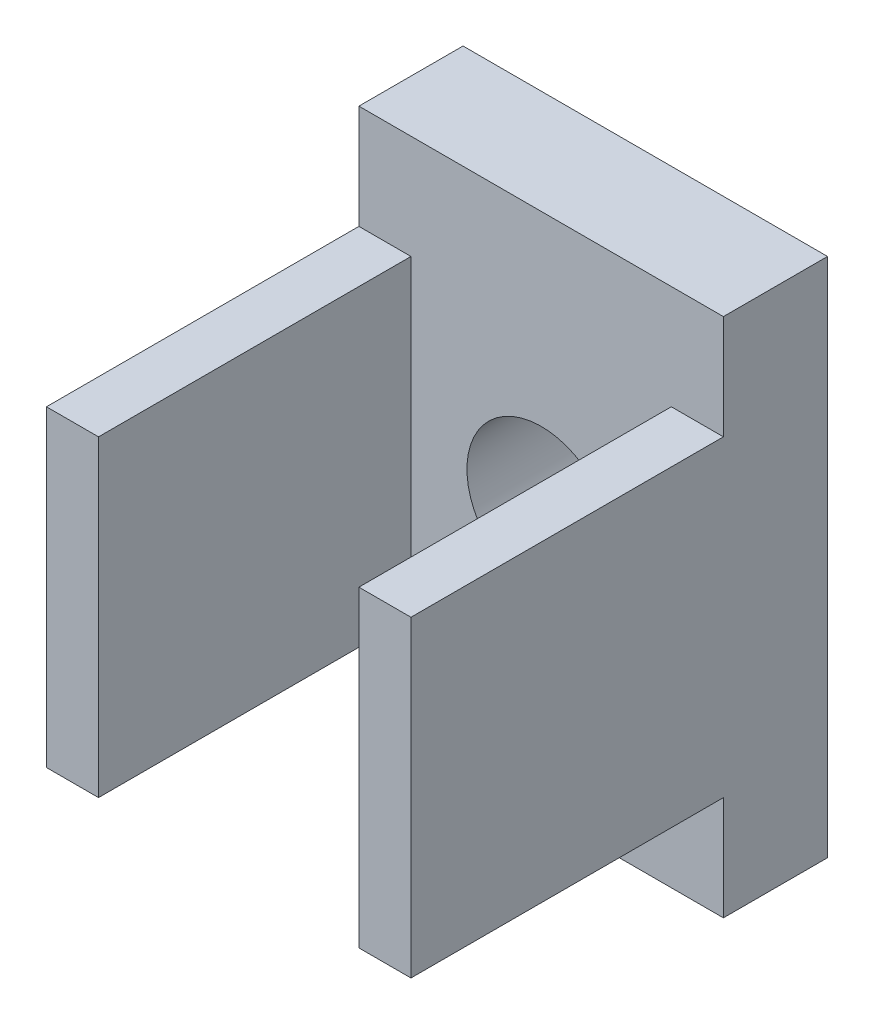
ISO-10303-21;
HEADER;
FILE_DESCRIPTION(('STEP AP214'),'2;1');
FILE_NAME('part.step','',(''),(''),'','','');
FILE_SCHEMA(('AUTOMOTIVE_DESIGN { 1 0 10303 214 1 1 1 1 }'));
ENDSEC;
DATA;
#1=APPLICATION_CONTEXT('core data for automotive mechanical design processes');
#2=APPLICATION_PROTOCOL_DEFINITION('international standard','automotive_design',2000,#1);
#3=PRODUCT_CONTEXT('',#1,'mechanical');
#4=PRODUCT('Part','Part','',(#3));
#5=PRODUCT_RELATED_PRODUCT_CATEGORY('part','',(#4));
#6=PRODUCT_DEFINITION_FORMATION('','',#4);
#7=PRODUCT_DEFINITION_CONTEXT('part definition',#1,'design');
#8=PRODUCT_DEFINITION('design','',#6,#7);
#9=PRODUCT_DEFINITION_SHAPE('','',#8);
#10=(LENGTH_UNIT() NAMED_UNIT(*) SI_UNIT(.MILLI.,.METRE.));
#11=(NAMED_UNIT(*) PLANE_ANGLE_UNIT() SI_UNIT($,.RADIAN.));
#12=(NAMED_UNIT(*) SI_UNIT($,.STERADIAN.) SOLID_ANGLE_UNIT());
#13=UNCERTAINTY_MEASURE_WITH_UNIT(LENGTH_MEASURE(1.E-05),#10,'distance_accuracy_value','');
#14=(GEOMETRIC_REPRESENTATION_CONTEXT(3) GLOBAL_UNCERTAINTY_ASSIGNED_CONTEXT((#13)) GLOBAL_UNIT_ASSIGNED_CONTEXT((#10,
#11,#12)) REPRESENTATION_CONTEXT('',''));
#15=CARTESIAN_POINT('',(0.,0.,0.));
#16=DIRECTION('',(0.,0.,1.));
#17=DIRECTION('',(1.,0.,0.));
#18=AXIS2_PLACEMENT_3D('',#15,#16,#17);
#19=CARTESIAN_POINT('',(0.,0.,2.));
#20=DIRECTION('',(0.,0.,1.));
#21=DIRECTION('',(1.,0.,0.));
#22=AXIS2_PLACEMENT_3D('',#19,#20,#21);
#23=PLANE('',#22);
#24=CARTESIAN_POINT('',(0.,0.,2.));
#25=DIRECTION('',(0.,0.,1.));
#26=DIRECTION('',(1.,0.,0.));
#27=AXIS2_PLACEMENT_3D('',#24,#25,#26);
#28=CIRCLE('',#27,1.425);
#29=CARTESIAN_POINT('',(1.425,0.,2.));
#30=VERTEX_POINT('',#29);
#31=EDGE_CURVE('E200',#30,#30,#28,.T.);
#32=ORIENTED_EDGE('',*,*,#31,.F.);
#33=EDGE_LOOP('',(#32));
#34=FACE_BOUND('',#33,.T.);
#35=DIRECTION('',(0.,1.,0.));
#36=VECTOR('',#35,1.);
#37=CARTESIAN_POINT('',(3.5,5.,2.));
#38=LINE('',#37,#36);
#39=CARTESIAN_POINT('',(3.5,-5.,2.));
#40=VERTEX_POINT('',#39);
#41=CARTESIAN_POINT('',(3.5,-3.,2.));
#42=VERTEX_POINT('',#41);
#43=EDGE_CURVE('E209',#40,#42,#38,.T.);
#44=ORIENTED_EDGE('',*,*,#43,.T.);
#45=DIRECTION('',(1.,0.,0.));
#46=VECTOR('',#45,1.);
#47=CARTESIAN_POINT('',(2.5,-3.,2.));
#48=LINE('',#47,#46);
#49=CARTESIAN_POINT('',(2.5,-3.,2.));
#50=VERTEX_POINT('',#49);
#51=EDGE_CURVE('E264',#50,#42,#48,.T.);
#52=ORIENTED_EDGE('',*,*,#51,.F.);
#53=DIRECTION('',(0.,-1.,0.));
#54=VECTOR('',#53,1.);
#55=CARTESIAN_POINT('',(2.5,3.,2.));
#56=LINE('',#55,#54);
#57=CARTESIAN_POINT('',(2.5,3.,2.));
#58=VERTEX_POINT('',#57);
#59=EDGE_CURVE('E154',#58,#50,#56,.T.);
#60=ORIENTED_EDGE('',*,*,#59,.F.);
#61=DIRECTION('',(-1.,0.,0.));
#62=VECTOR('',#61,1.);
#63=CARTESIAN_POINT('',(3.5,3.,2.));
#64=LINE('',#63,#62);
#65=CARTESIAN_POINT('',(3.5,3.,2.));
#66=VERTEX_POINT('',#65);
#67=EDGE_CURVE('E150',#66,#58,#64,.T.);
#68=ORIENTED_EDGE('',*,*,#67,.F.);
#69=CARTESIAN_POINT('',(3.5,5.,2.));
#70=VERTEX_POINT('',#69);
#71=EDGE_CURVE('E214',#66,#70,#38,.T.);
#72=ORIENTED_EDGE('',*,*,#71,.T.);
#73=DIRECTION('',(-1.,0.,0.));
#74=VECTOR('',#73,1.);
#75=CARTESIAN_POINT('',(-3.5,5.,2.));
#76=LINE('',#75,#74);
#77=CARTESIAN_POINT('',(-3.5,5.,2.));
#78=VERTEX_POINT('',#77);
#79=EDGE_CURVE('E213',#70,#78,#76,.T.);
#80=ORIENTED_EDGE('',*,*,#79,.T.);
#81=DIRECTION('',(0.,-1.,0.));
#82=VECTOR('',#81,1.);
#83=CARTESIAN_POINT('',(-3.5,5.,2.));
#84=LINE('',#83,#82);
#85=CARTESIAN_POINT('',(-3.5,3.,2.));
#86=VERTEX_POINT('',#85);
#87=EDGE_CURVE('E218',#78,#86,#84,.T.);
#88=ORIENTED_EDGE('',*,*,#87,.T.);
#89=DIRECTION('',(-1.,0.,0.));
#90=VECTOR('',#89,1.);
#91=CARTESIAN_POINT('',(-3.5,3.,2.));
#92=LINE('',#91,#90);
#93=CARTESIAN_POINT('',(-2.5,3.,2.));
#94=VERTEX_POINT('',#93);
#95=EDGE_CURVE('E63',#94,#86,#92,.T.);
#96=ORIENTED_EDGE('',*,*,#95,.F.);
#97=DIRECTION('',(0.,1.,0.));
#98=VECTOR('',#97,1.);
#99=CARTESIAN_POINT('',(-2.5,3.,2.));
#100=LINE('',#99,#98);
#101=CARTESIAN_POINT('',(-2.5,-3.,2.));
#102=VERTEX_POINT('',#101);
#103=EDGE_CURVE('E162',#102,#94,#100,.T.);
#104=ORIENTED_EDGE('',*,*,#103,.F.);
#105=DIRECTION('',(1.,0.,0.));
#106=VECTOR('',#105,1.);
#107=CARTESIAN_POINT('',(-2.5,-3.,2.));
#108=LINE('',#107,#106);
#109=CARTESIAN_POINT('',(-3.5,-3.,2.));
#110=VERTEX_POINT('',#109);
#111=EDGE_CURVE('E157',#110,#102,#108,.T.);
#112=ORIENTED_EDGE('',*,*,#111,.F.);
#113=CARTESIAN_POINT('',(-3.5,-5.,2.));
#114=VERTEX_POINT('',#113);
#115=EDGE_CURVE('E217',#110,#114,#84,.T.);
#116=ORIENTED_EDGE('',*,*,#115,.T.);
#117=DIRECTION('',(1.,0.,0.));
#118=VECTOR('',#117,1.);
#119=CARTESIAN_POINT('',(-3.5,-5.,2.));
#120=LINE('',#119,#118);
#121=EDGE_CURVE('E221',#114,#40,#120,.T.);
#122=ORIENTED_EDGE('',*,*,#121,.T.);
#123=EDGE_LOOP('',(#44,#52,#60,#68,#72,#80,#88,#96,#104,#112,#116,#122));
#124=FACE_BOUND('',#123,.T.);
#125=ADVANCED_FACE('F39',(#34,#124),#23,.T.);
#126=CARTESIAN_POINT('',(3.5,5.,2.));
#127=DIRECTION('',(-1.,0.,0.));
#128=DIRECTION('',(0.,0.,1.));
#129=AXIS2_PLACEMENT_3D('',#126,#127,#128);
#130=PLANE('',#129);
#131=DIRECTION('',(0.,1.,0.));
#132=VECTOR('',#131,1.);
#133=CARTESIAN_POINT('',(3.5,5.,0.));
#134=LINE('',#133,#132);
#135=CARTESIAN_POINT('',(3.5,-5.,0.));
#136=VERTEX_POINT('',#135);
#137=CARTESIAN_POINT('',(3.5,5.,0.));
#138=VERTEX_POINT('',#137);
#139=EDGE_CURVE('E205',#136,#138,#134,.T.);
#140=ORIENTED_EDGE('',*,*,#139,.T.);
#141=DIRECTION('',(0.,0.,-1.));
#142=VECTOR('',#141,1.);
#143=CARTESIAN_POINT('',(3.5,5.,2.));
#144=LINE('',#143,#142);
#145=EDGE_CURVE('E11',#70,#138,#144,.T.);
#146=ORIENTED_EDGE('',*,*,#145,.F.);
#147=ORIENTED_EDGE('',*,*,#71,.F.);
#148=DIRECTION('',(0.,0.,-1.));
#149=VECTOR('',#148,1.);
#150=CARTESIAN_POINT('',(3.5,3.,8.));
#151=LINE('',#150,#149);
#152=CARTESIAN_POINT('',(3.5,3.,8.));
#153=VERTEX_POINT('',#152);
#154=EDGE_CURVE('E55',#153,#66,#151,.T.);
#155=ORIENTED_EDGE('',*,*,#154,.F.);
#156=DIRECTION('',(0.,1.,0.));
#157=VECTOR('',#156,1.);
#158=CARTESIAN_POINT('',(3.5,-3.,8.));
#159=LINE('',#158,#157);
#160=CARTESIAN_POINT('',(3.5,-3.,8.));
#161=VERTEX_POINT('',#160);
#162=EDGE_CURVE('E140',#161,#153,#159,.T.);
#163=ORIENTED_EDGE('',*,*,#162,.F.);
#164=DIRECTION('',(0.,0.,-1.));
#165=VECTOR('',#164,1.);
#166=CARTESIAN_POINT('',(3.5,-3.,8.));
#167=LINE('',#166,#165);
#168=EDGE_CURVE('E136',#161,#42,#167,.T.);
#169=ORIENTED_EDGE('',*,*,#168,.T.);
#170=ORIENTED_EDGE('',*,*,#43,.F.);
#171=DIRECTION('',(0.,0.,-1.));
#172=VECTOR('',#171,1.);
#173=CARTESIAN_POINT('',(3.5,-5.,2.));
#174=LINE('',#173,#172);
#175=EDGE_CURVE('E224',#40,#136,#174,.T.);
#176=ORIENTED_EDGE('',*,*,#175,.T.);
#177=EDGE_LOOP('',(#140,#146,#147,#155,#163,#169,#170,#176));
#178=FACE_BOUND('',#177,.T.);
#179=ADVANCED_FACE('F41',(#178),#130,.F.);
#180=CARTESIAN_POINT('',(-3.5,5.,2.));
#181=DIRECTION('',(0.,-1.,0.));
#182=DIRECTION('',(0.,0.,-1.));
#183=AXIS2_PLACEMENT_3D('',#180,#181,#182);
#184=PLANE('',#183);
#185=DIRECTION('',(-1.,0.,0.));
#186=VECTOR('',#185,1.);
#187=CARTESIAN_POINT('',(-3.5,5.,0.));
#188=LINE('',#187,#186);
#189=CARTESIAN_POINT('',(-3.5,5.,0.));
#190=VERTEX_POINT('',#189);
#191=EDGE_CURVE('E228',#138,#190,#188,.T.);
#192=ORIENTED_EDGE('',*,*,#191,.T.);
#193=DIRECTION('',(0.,0.,-1.));
#194=VECTOR('',#193,1.);
#195=CARTESIAN_POINT('',(-3.5,5.,2.));
#196=LINE('',#195,#194);
#197=EDGE_CURVE('E48',#78,#190,#196,.T.);
#198=ORIENTED_EDGE('',*,*,#197,.F.);
#199=ORIENTED_EDGE('',*,*,#79,.F.);
#200=ORIENTED_EDGE('',*,*,#145,.T.);
#201=EDGE_LOOP('',(#192,#198,#199,#200));
#202=FACE_BOUND('',#201,.T.);
#203=ADVANCED_FACE('F270',(#202),#184,.F.);
#204=CARTESIAN_POINT('',(-3.5,5.,2.));
#205=DIRECTION('',(1.,0.,0.));
#206=DIRECTION('',(0.,0.,-1.));
#207=AXIS2_PLACEMENT_3D('',#204,#205,#206);
#208=PLANE('',#207);
#209=DIRECTION('',(0.,-1.,0.));
#210=VECTOR('',#209,1.);
#211=CARTESIAN_POINT('',(-3.5,5.,0.));
#212=LINE('',#211,#210);
#213=CARTESIAN_POINT('',(-3.5,-5.,0.));
#214=VERTEX_POINT('',#213);
#215=EDGE_CURVE('E231',#190,#214,#212,.T.);
#216=ORIENTED_EDGE('',*,*,#215,.T.);
#217=DIRECTION('',(0.,0.,-1.));
#218=VECTOR('',#217,1.);
#219=CARTESIAN_POINT('',(-3.5,-5.,2.));
#220=LINE('',#219,#218);
#221=EDGE_CURVE('E240',#114,#214,#220,.T.);
#222=ORIENTED_EDGE('',*,*,#221,.F.);
#223=ORIENTED_EDGE('',*,*,#115,.F.);
#224=DIRECTION('',(0.,0.,-1.));
#225=VECTOR('',#224,1.);
#226=CARTESIAN_POINT('',(-3.5,-3.,8.));
#227=LINE('',#226,#225);
#228=CARTESIAN_POINT('',(-3.5,-3.,8.));
#229=VERTEX_POINT('',#228);
#230=EDGE_CURVE('E196',#229,#110,#227,.T.);
#231=ORIENTED_EDGE('',*,*,#230,.F.);
#232=DIRECTION('',(0.,-1.,0.));
#233=VECTOR('',#232,1.);
#234=CARTESIAN_POINT('',(-3.5,-3.,8.));
#235=LINE('',#234,#233);
#236=CARTESIAN_POINT('',(-3.5,3.,8.));
#237=VERTEX_POINT('',#236);
#238=EDGE_CURVE('E167',#237,#229,#235,.T.);
#239=ORIENTED_EDGE('',*,*,#238,.F.);
#240=DIRECTION('',(0.,0.,-1.));
#241=VECTOR('',#240,1.);
#242=CARTESIAN_POINT('',(-3.5,3.,8.));
#243=LINE('',#242,#241);
#244=EDGE_CURVE('E179',#237,#86,#243,.T.);
#245=ORIENTED_EDGE('',*,*,#244,.T.);
#246=ORIENTED_EDGE('',*,*,#87,.F.);
#247=ORIENTED_EDGE('',*,*,#197,.T.);
#248=EDGE_LOOP('',(#216,#222,#223,#231,#239,#245,#246,#247));
#249=FACE_BOUND('',#248,.T.);
#250=ADVANCED_FACE('F249',(#249),#208,.F.);
#251=CARTESIAN_POINT('',(-3.5,-5.,2.));
#252=DIRECTION('',(0.,1.,0.));
#253=DIRECTION('',(0.,0.,1.));
#254=AXIS2_PLACEMENT_3D('',#251,#252,#253);
#255=PLANE('',#254);
#256=DIRECTION('',(1.,0.,0.));
#257=VECTOR('',#256,1.);
#258=CARTESIAN_POINT('',(-3.5,-5.,0.));
#259=LINE('',#258,#257);
#260=EDGE_CURVE('E234',#214,#136,#259,.T.);
#261=ORIENTED_EDGE('',*,*,#260,.T.);
#262=ORIENTED_EDGE('',*,*,#175,.F.);
#263=ORIENTED_EDGE('',*,*,#121,.F.);
#264=ORIENTED_EDGE('',*,*,#221,.T.);
#265=EDGE_LOOP('',(#261,#262,#263,#264));
#266=FACE_BOUND('',#265,.T.);
#267=ADVANCED_FACE('F259',(#266),#255,.F.);
#268=CARTESIAN_POINT('',(0.,0.,0.));
#269=DIRECTION('',(0.,0.,1.));
#270=DIRECTION('',(1.,0.,0.));
#271=AXIS2_PLACEMENT_3D('',#268,#269,#270);
#272=PLANE('',#271);
#273=CARTESIAN_POINT('',(0.,0.,0.));
#274=DIRECTION('',(0.,0.,1.));
#275=DIRECTION('',(1.,0.,0.));
#276=AXIS2_PLACEMENT_3D('',#273,#274,#275);
#277=CIRCLE('',#276,1.425);
#278=CARTESIAN_POINT('',(1.425,0.,0.));
#279=VERTEX_POINT('',#278);
#280=EDGE_CURVE('E201',#279,#279,#277,.T.);
#281=ORIENTED_EDGE('',*,*,#280,.T.);
#282=EDGE_LOOP('',(#281));
#283=FACE_BOUND('',#282,.T.);
#284=ORIENTED_EDGE('',*,*,#139,.F.);
#285=ORIENTED_EDGE('',*,*,#260,.F.);
#286=ORIENTED_EDGE('',*,*,#215,.F.);
#287=ORIENTED_EDGE('',*,*,#191,.F.);
#288=EDGE_LOOP('',(#284,#285,#286,#287));
#289=FACE_BOUND('',#288,.T.);
#290=ADVANCED_FACE('F256',(#283,#289),#272,.F.);
#291=CARTESIAN_POINT('',(0.,0.,0.));
#292=DIRECTION('',(0.,0.,1.));
#293=DIRECTION('',(1.,0.,0.));
#294=AXIS2_PLACEMENT_3D('',#291,#292,#293);
#295=CYLINDRICAL_SURFACE('',#294,1.425);
#296=ORIENTED_EDGE('',*,*,#280,.F.);
#297=EDGE_LOOP('',(#296));
#298=FACE_BOUND('',#297,.T.);
#299=ORIENTED_EDGE('',*,*,#31,.T.);
#300=EDGE_LOOP('',(#299));
#301=FACE_BOUND('',#300,.T.);
#302=ADVANCED_FACE('F285',(#298,#301),#295,.F.);
#303=CARTESIAN_POINT('',(-2.5,-3.,8.));
#304=DIRECTION('',(0.,1.,0.));
#305=DIRECTION('',(-1.,0.,0.));
#306=AXIS2_PLACEMENT_3D('',#303,#304,#305);
#307=PLANE('',#306);
#308=ORIENTED_EDGE('',*,*,#111,.T.);
#309=DIRECTION('',(0.,0.,-1.));
#310=VECTOR('',#309,1.);
#311=CARTESIAN_POINT('',(-2.5,-3.,8.));
#312=LINE('',#311,#310);
#313=CARTESIAN_POINT('',(-2.5,-3.,8.));
#314=VERTEX_POINT('',#313);
#315=EDGE_CURVE('E192',#314,#102,#312,.T.);
#316=ORIENTED_EDGE('',*,*,#315,.F.);
#317=DIRECTION('',(1.,0.,0.));
#318=VECTOR('',#317,1.);
#319=CARTESIAN_POINT('',(-2.5,-3.,8.));
#320=LINE('',#319,#318);
#321=EDGE_CURVE('E171',#229,#314,#320,.T.);
#322=ORIENTED_EDGE('',*,*,#321,.F.);
#323=ORIENTED_EDGE('',*,*,#230,.T.);
#324=EDGE_LOOP('',(#308,#316,#322,#323));
#325=FACE_BOUND('',#324,.T.);
#326=ADVANCED_FACE('F305',(#325),#307,.F.);
#327=CARTESIAN_POINT('',(-2.5,3.,8.));
#328=DIRECTION('',(-1.,0.,0.));
#329=DIRECTION('',(0.,-1.,0.));
#330=AXIS2_PLACEMENT_3D('',#327,#328,#329);
#331=PLANE('',#330);
#332=ORIENTED_EDGE('',*,*,#103,.T.);
#333=DIRECTION('',(0.,0.,-1.));
#334=VECTOR('',#333,1.);
#335=CARTESIAN_POINT('',(-2.5,3.,8.));
#336=LINE('',#335,#334);
#337=CARTESIAN_POINT('',(-2.5,3.,8.));
#338=VERTEX_POINT('',#337);
#339=EDGE_CURVE('E188',#338,#94,#336,.T.);
#340=ORIENTED_EDGE('',*,*,#339,.F.);
#341=DIRECTION('',(0.,1.,0.));
#342=VECTOR('',#341,1.);
#343=CARTESIAN_POINT('',(-2.5,3.,8.));
#344=LINE('',#343,#342);
#345=EDGE_CURVE('E174',#314,#338,#344,.T.);
#346=ORIENTED_EDGE('',*,*,#345,.F.);
#347=ORIENTED_EDGE('',*,*,#315,.T.);
#348=EDGE_LOOP('',(#332,#340,#346,#347));
#349=FACE_BOUND('',#348,.T.);
#350=ADVANCED_FACE('F312',(#349),#331,.F.);
#351=CARTESIAN_POINT('',(-3.5,3.,8.));
#352=DIRECTION('',(0.,-1.,0.));
#353=DIRECTION('',(0.,0.,-1.));
#354=AXIS2_PLACEMENT_3D('',#351,#352,#353);
#355=PLANE('',#354);
#356=ORIENTED_EDGE('',*,*,#95,.T.);
#357=ORIENTED_EDGE('',*,*,#244,.F.);
#358=DIRECTION('',(-1.,0.,0.));
#359=VECTOR('',#358,1.);
#360=CARTESIAN_POINT('',(-3.5,3.,8.));
#361=LINE('',#360,#359);
#362=EDGE_CURVE('E177',#338,#237,#361,.T.);
#363=ORIENTED_EDGE('',*,*,#362,.F.);
#364=ORIENTED_EDGE('',*,*,#339,.T.);
#365=EDGE_LOOP('',(#356,#357,#363,#364));
#366=FACE_BOUND('',#365,.T.);
#367=ADVANCED_FACE('F319',(#366),#355,.F.);
#368=CARTESIAN_POINT('',(0.,0.,8.));
#369=DIRECTION('',(0.,0.,-1.));
#370=DIRECTION('',(-1.,0.,0.));
#371=AXIS2_PLACEMENT_3D('',#368,#369,#370);
#372=PLANE('',#371);
#373=ORIENTED_EDGE('',*,*,#238,.T.);
#374=ORIENTED_EDGE('',*,*,#321,.T.);
#375=ORIENTED_EDGE('',*,*,#345,.T.);
#376=ORIENTED_EDGE('',*,*,#362,.T.);
#377=EDGE_LOOP('',(#373,#374,#375,#376));
#378=FACE_BOUND('',#377,.T.);
#379=ADVANCED_FACE('F327',(#378),#372,.F.);
#380=CARTESIAN_POINT('',(2.5,3.,8.));
#381=DIRECTION('',(1.,0.,0.));
#382=DIRECTION('',(0.,1.,0.));
#383=AXIS2_PLACEMENT_3D('',#380,#381,#382);
#384=PLANE('',#383);
#385=ORIENTED_EDGE('',*,*,#59,.T.);
#386=DIRECTION('',(0.,0.,-1.));
#387=VECTOR('',#386,1.);
#388=CARTESIAN_POINT('',(2.5,-3.,8.));
#389=LINE('',#388,#387);
#390=CARTESIAN_POINT('',(2.5,-3.,8.));
#391=VERTEX_POINT('',#390);
#392=EDGE_CURVE('E133',#391,#50,#389,.T.);
#393=ORIENTED_EDGE('',*,*,#392,.F.);
#394=DIRECTION('',(0.,-1.,0.));
#395=VECTOR('',#394,1.);
#396=CARTESIAN_POINT('',(2.5,3.,8.));
#397=LINE('',#396,#395);
#398=CARTESIAN_POINT('',(2.5,3.,8.));
#399=VERTEX_POINT('',#398);
#400=EDGE_CURVE('E141',#399,#391,#397,.T.);
#401=ORIENTED_EDGE('',*,*,#400,.F.);
#402=DIRECTION('',(0.,0.,-1.));
#403=VECTOR('',#402,1.);
#404=CARTESIAN_POINT('',(2.5,3.,8.));
#405=LINE('',#404,#403);
#406=EDGE_CURVE('E409',#399,#58,#405,.T.);
#407=ORIENTED_EDGE('',*,*,#406,.T.);
#408=EDGE_LOOP('',(#385,#393,#401,#407));
#409=FACE_BOUND('',#408,.T.);
#410=ADVANCED_FACE('F152',(#409),#384,.F.);
#411=CARTESIAN_POINT('',(2.5,-3.,8.));
#412=DIRECTION('',(0.,1.,0.));
#413=DIRECTION('',(-1.,0.,0.));
#414=AXIS2_PLACEMENT_3D('',#411,#412,#413);
#415=PLANE('',#414);
#416=ORIENTED_EDGE('',*,*,#51,.T.);
#417=ORIENTED_EDGE('',*,*,#168,.F.);
#418=DIRECTION('',(1.,0.,0.));
#419=VECTOR('',#418,1.);
#420=CARTESIAN_POINT('',(2.5,-3.,8.));
#421=LINE('',#420,#419);
#422=EDGE_CURVE('E129',#391,#161,#421,.T.);
#423=ORIENTED_EDGE('',*,*,#422,.F.);
#424=ORIENTED_EDGE('',*,*,#392,.T.);
#425=EDGE_LOOP('',(#416,#417,#423,#424));
#426=FACE_BOUND('',#425,.T.);
#427=ADVANCED_FACE('F131',(#426),#415,.F.);
#428=CARTESIAN_POINT('',(3.5,3.,8.));
#429=DIRECTION('',(0.,-1.,0.));
#430=DIRECTION('',(0.,0.,-1.));
#431=AXIS2_PLACEMENT_3D('',#428,#429,#430);
#432=PLANE('',#431);
#433=ORIENTED_EDGE('',*,*,#67,.T.);
#434=ORIENTED_EDGE('',*,*,#406,.F.);
#435=DIRECTION('',(-1.,0.,0.));
#436=VECTOR('',#435,1.);
#437=CARTESIAN_POINT('',(3.5,3.,8.));
#438=LINE('',#437,#436);
#439=EDGE_CURVE('E145',#153,#399,#438,.T.);
#440=ORIENTED_EDGE('',*,*,#439,.F.);
#441=ORIENTED_EDGE('',*,*,#154,.T.);
#442=EDGE_LOOP('',(#433,#434,#440,#441));
#443=FACE_BOUND('',#442,.T.);
#444=ADVANCED_FACE('F348',(#443),#432,.F.);
#445=CARTESIAN_POINT('',(0.,0.,8.));
#446=DIRECTION('',(0.,0.,1.));
#447=DIRECTION('',(1.,0.,0.));
#448=AXIS2_PLACEMENT_3D('',#445,#446,#447);
#449=PLANE('',#448);
#450=ORIENTED_EDGE('',*,*,#400,.T.);
#451=ORIENTED_EDGE('',*,*,#422,.T.);
#452=ORIENTED_EDGE('',*,*,#162,.T.);
#453=ORIENTED_EDGE('',*,*,#439,.T.);
#454=EDGE_LOOP('',(#450,#451,#452,#453));
#455=FACE_BOUND('',#454,.T.);
#456=ADVANCED_FACE('F144',(#455),#449,.T.);
#457=CLOSED_SHELL('',(#125,#179,#203,#250,#267,#290,#302,#326,#350,#367,#379,#410,#427,#444,#456));
#458=MANIFOLD_SOLID_BREP('B2',#457);
#459=ADVANCED_BREP_SHAPE_REPRESENTATION('',(#18,#458),#14);
#460=SHAPE_DEFINITION_REPRESENTATION(#9,#459);
ENDSEC;
END-ISO-10303-21;
